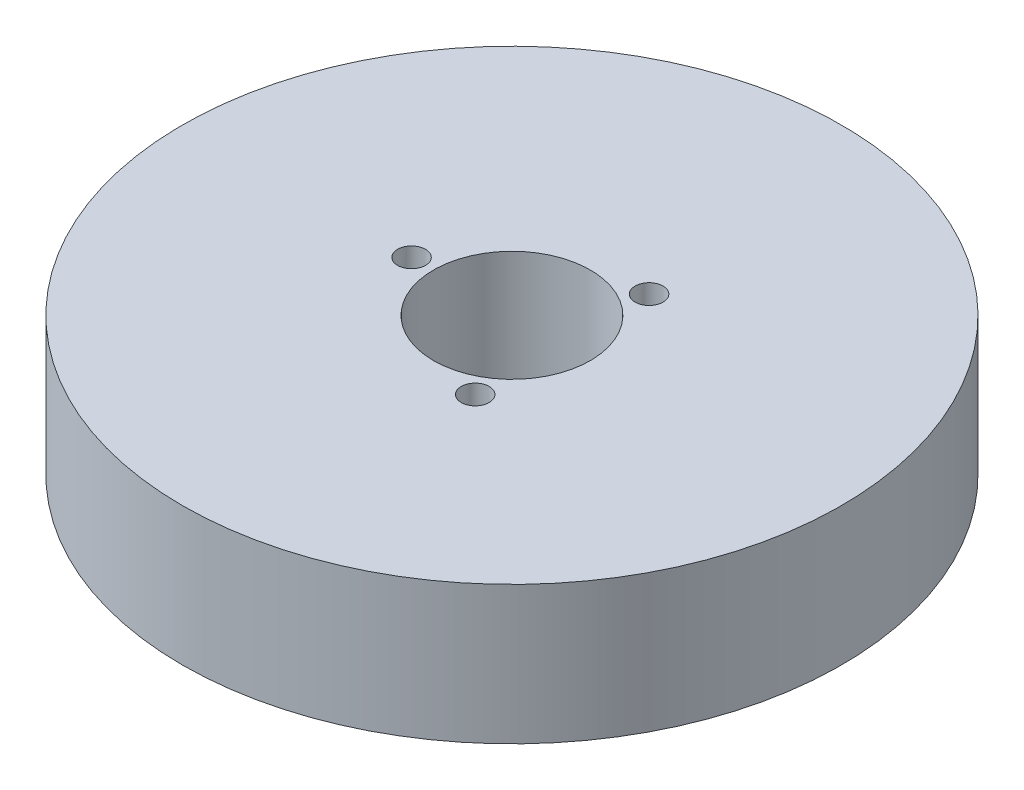
ISO-10303-21;
HEADER;
FILE_DESCRIPTION(('STEP AP214'),'2;1');
FILE_NAME('part.step','',(''),(''),'','','');
FILE_SCHEMA(('AUTOMOTIVE_DESIGN { 1 0 10303 214 1 1 1 1 }'));
ENDSEC;
DATA;
#1=APPLICATION_CONTEXT('core data for automotive mechanical design processes');
#2=APPLICATION_PROTOCOL_DEFINITION('international standard','automotive_design',2000,#1);
#3=PRODUCT_CONTEXT('',#1,'mechanical');
#4=PRODUCT('Part','Part','',(#3));
#5=PRODUCT_RELATED_PRODUCT_CATEGORY('part','',(#4));
#6=PRODUCT_DEFINITION_FORMATION('','',#4);
#7=PRODUCT_DEFINITION_CONTEXT('part definition',#1,'design');
#8=PRODUCT_DEFINITION('design','',#6,#7);
#9=PRODUCT_DEFINITION_SHAPE('','',#8);
#10=(LENGTH_UNIT() NAMED_UNIT(*) SI_UNIT(.MILLI.,.METRE.));
#11=(NAMED_UNIT(*) PLANE_ANGLE_UNIT() SI_UNIT($,.RADIAN.));
#12=(NAMED_UNIT(*) SI_UNIT($,.STERADIAN.) SOLID_ANGLE_UNIT());
#13=UNCERTAINTY_MEASURE_WITH_UNIT(LENGTH_MEASURE(1.E-05),#10,'distance_accuracy_value','');
#14=(GEOMETRIC_REPRESENTATION_CONTEXT(3) GLOBAL_UNCERTAINTY_ASSIGNED_CONTEXT((#13)) GLOBAL_UNIT_ASSIGNED_CONTEXT((#10,
#11,#12)) REPRESENTATION_CONTEXT('',''));
#15=CARTESIAN_POINT('',(0.,0.,0.));
#16=DIRECTION('',(0.,0.,1.));
#17=DIRECTION('',(1.,0.,0.));
#18=AXIS2_PLACEMENT_3D('',#15,#16,#17);
#19=CARTESIAN_POINT('',(0.,22.,0.));
#20=DIRECTION('',(0.,-1.,0.));
#21=DIRECTION('',(0.,0.,-1.));
#22=AXIS2_PLACEMENT_3D('',#19,#20,#21);
#23=CYLINDRICAL_SURFACE('',#22,52.5);
#24=CARTESIAN_POINT('',(0.,22.,0.));
#25=DIRECTION('',(0.,1.,0.));
#26=DIRECTION('',(0.,0.,1.));
#27=AXIS2_PLACEMENT_3D('',#24,#25,#26);
#28=CIRCLE('',#27,52.5);
#29=CARTESIAN_POINT('',(0.,22.,52.5));
#30=VERTEX_POINT('',#29);
#31=EDGE_CURVE('E10',#30,#30,#28,.T.);
#32=ORIENTED_EDGE('',*,*,#31,.F.);
#33=EDGE_LOOP('',(#32));
#34=FACE_BOUND('',#33,.T.);
#35=CARTESIAN_POINT('',(0.,0.,0.));
#36=DIRECTION('',(0.,1.,0.));
#37=DIRECTION('',(0.,0.,1.));
#38=AXIS2_PLACEMENT_3D('',#35,#36,#37);
#39=CIRCLE('',#38,52.5);
#40=CARTESIAN_POINT('',(0.,0.,52.5));
#41=VERTEX_POINT('',#40);
#42=EDGE_CURVE('E37',#41,#41,#39,.T.);
#43=ORIENTED_EDGE('',*,*,#42,.T.);
#44=EDGE_LOOP('',(#43));
#45=FACE_BOUND('',#44,.T.);
#46=ADVANCED_FACE('F40',(#34,#45),#23,.T.);
#47=CARTESIAN_POINT('',(0.,22.,0.));
#48=DIRECTION('',(0.,1.,0.));
#49=DIRECTION('',(0.,0.,1.));
#50=AXIS2_PLACEMENT_3D('',#47,#48,#49);
#51=PLANE('',#50);
#52=CARTESIAN_POINT('',(7.99627412123453,22.,13.8499530492262));
#53=DIRECTION('',(0.,1.,0.));
#54=DIRECTION('',(0.866025403784436,0.,-0.500000000000004));
#55=AXIS2_PLACEMENT_3D('',#52,#53,#54);
#56=CIRCLE('',#55,2.22604315183564);
#57=CARTESIAN_POINT('',(9.92408404064456,22.,12.7369314733084));
#58=VERTEX_POINT('',#57);
#59=EDGE_CURVE('E70',#58,#58,#56,.T.);
#60=ORIENTED_EDGE('',*,*,#59,.F.);
#61=EDGE_LOOP('',(#60));
#62=FACE_BOUND('',#61,.T.);
#63=CARTESIAN_POINT('',(7.99627412123433,22.,-13.8499530492263));
#64=DIRECTION('',(0.,1.,0.));
#65=DIRECTION('',(-0.866025403784443,0.,-0.499999999999992));
#66=AXIS2_PLACEMENT_3D('',#63,#64,#65);
#67=CIRCLE('',#66,2.22604315183564);
#68=CARTESIAN_POINT('',(6.06846420182428,22.,-14.9629746251441));
#69=VERTEX_POINT('',#68);
#70=EDGE_CURVE('E61',#69,#69,#67,.T.);
#71=ORIENTED_EDGE('',*,*,#70,.F.);
#72=EDGE_LOOP('',(#71));
#73=FACE_BOUND('',#72,.T.);
#74=CARTESIAN_POINT('',(-15.9925482424689,22.,0.));
#75=DIRECTION('',(0.,1.,0.));
#76=DIRECTION('',(0.,0.,1.));
#77=AXIS2_PLACEMENT_3D('',#74,#75,#76);
#78=CIRCLE('',#77,2.22604315183564);
#79=CARTESIAN_POINT('',(-15.9925482424689,22.,2.22604315183564));
#80=VERTEX_POINT('',#79);
#81=EDGE_CURVE('E54',#80,#80,#78,.T.);
#82=ORIENTED_EDGE('',*,*,#81,.F.);
#83=EDGE_LOOP('',(#82));
#84=FACE_BOUND('',#83,.T.);
#85=CARTESIAN_POINT('',(0.,22.,0.));
#86=DIRECTION('',(0.,1.,0.));
#87=DIRECTION('',(0.,0.,1.));
#88=AXIS2_PLACEMENT_3D('',#85,#86,#87);
#89=CIRCLE('',#88,12.5);
#90=CARTESIAN_POINT('',(0.,22.,12.5));
#91=VERTEX_POINT('',#90);
#92=EDGE_CURVE('E50',#91,#91,#89,.T.);
#93=ORIENTED_EDGE('',*,*,#92,.F.);
#94=EDGE_LOOP('',(#93));
#95=FACE_BOUND('',#94,.T.);
#96=ORIENTED_EDGE('',*,*,#31,.T.);
#97=EDGE_LOOP('',(#96));
#98=FACE_BOUND('',#97,.T.);
#99=ADVANCED_FACE('F85',(#62,#73,#84,#95,#98),#51,.T.);
#100=CARTESIAN_POINT('',(0.,0.,0.));
#101=DIRECTION('',(0.,1.,0.));
#102=DIRECTION('',(0.,0.,1.));
#103=AXIS2_PLACEMENT_3D('',#100,#101,#102);
#104=PLANE('',#103);
#105=CARTESIAN_POINT('',(0.,0.,0.));
#106=DIRECTION('',(0.,1.,0.));
#107=DIRECTION('',(0.,0.,1.));
#108=AXIS2_PLACEMENT_3D('',#105,#106,#107);
#109=CIRCLE('',#108,12.5);
#110=CARTESIAN_POINT('',(0.,0.,12.5));
#111=VERTEX_POINT('',#110);
#112=EDGE_CURVE('E47',#111,#111,#109,.T.);
#113=ORIENTED_EDGE('',*,*,#112,.T.);
#114=EDGE_LOOP('',(#113));
#115=FACE_BOUND('',#114,.T.);
#116=ORIENTED_EDGE('',*,*,#42,.F.);
#117=EDGE_LOOP('',(#116));
#118=FACE_BOUND('',#117,.T.);
#119=ADVANCED_FACE('F84',(#115,#118),#104,.F.);
#120=CARTESIAN_POINT('',(0.,22.,0.));
#121=DIRECTION('',(0.,-1.,0.));
#122=DIRECTION('',(0.,0.,-1.));
#123=AXIS2_PLACEMENT_3D('',#120,#121,#122);
#124=CYLINDRICAL_SURFACE('',#123,12.5);
#125=ORIENTED_EDGE('',*,*,#92,.T.);
#126=EDGE_LOOP('',(#125));
#127=FACE_BOUND('',#126,.T.);
#128=ORIENTED_EDGE('',*,*,#112,.F.);
#129=EDGE_LOOP('',(#128));
#130=FACE_BOUND('',#129,.T.);
#131=ADVANCED_FACE('F91',(#127,#130),#124,.F.);
#132=CARTESIAN_POINT('',(-15.9925482424689,6.56872823832589,0.));
#133=DIRECTION('',(0.,1.,0.));
#134=DIRECTION('',(0.,0.,1.));
#135=AXIS2_PLACEMENT_3D('',#132,#133,#134);
#136=CYLINDRICAL_SURFACE('',#135,2.22604315183564);
#137=CARTESIAN_POINT('',(-15.9925482424689,6.56872823832589,0.));
#138=DIRECTION('',(0.,1.,0.));
#139=DIRECTION('',(0.,0.,1.));
#140=AXIS2_PLACEMENT_3D('',#137,#138,#139);
#141=CIRCLE('',#140,2.22604315183564);
#142=CARTESIAN_POINT('',(-15.9925482424689,6.56872823832589,2.22604315183564));
#143=VERTEX_POINT('',#142);
#144=EDGE_CURVE('E55',#143,#143,#141,.T.);
#145=ORIENTED_EDGE('',*,*,#144,.F.);
#146=EDGE_LOOP('',(#145));
#147=FACE_BOUND('',#146,.T.);
#148=ORIENTED_EDGE('',*,*,#81,.T.);
#149=EDGE_LOOP('',(#148));
#150=FACE_BOUND('',#149,.T.);
#151=ADVANCED_FACE('F96',(#147,#150),#136,.F.);
#152=CARTESIAN_POINT('',(-15.9925482424689,6.56872823832589,0.));
#153=DIRECTION('',(0.,1.,0.));
#154=DIRECTION('',(0.,0.,1.));
#155=AXIS2_PLACEMENT_3D('',#152,#153,#154);
#156=PLANE('',#155);
#157=ORIENTED_EDGE('',*,*,#144,.T.);
#158=EDGE_LOOP('',(#157));
#159=FACE_BOUND('',#158,.T.);
#160=ADVANCED_FACE('F127',(#159),#156,.T.);
#161=CARTESIAN_POINT('',(7.99627412123433,6.56872823832589,-13.8499530492263));
#162=DIRECTION('',(0.,1.,0.));
#163=DIRECTION('',(0.,0.,1.));
#164=AXIS2_PLACEMENT_3D('',#161,#162,#163);
#165=CYLINDRICAL_SURFACE('',#164,2.22604315183564);
#166=CARTESIAN_POINT('',(7.99627412123433,6.56872823832589,-13.8499530492263));
#167=DIRECTION('',(0.,1.,0.));
#168=DIRECTION('',(-0.866025403784443,0.,-0.499999999999992));
#169=AXIS2_PLACEMENT_3D('',#166,#167,#168);
#170=CIRCLE('',#169,2.22604315183564);
#171=CARTESIAN_POINT('',(6.06846420182428,6.56872823832589,-14.9629746251441));
#172=VERTEX_POINT('',#171);
#173=EDGE_CURVE('E63',#172,#172,#170,.T.);
#174=ORIENTED_EDGE('',*,*,#173,.F.);
#175=EDGE_LOOP('',(#174));
#176=FACE_BOUND('',#175,.T.);
#177=ORIENTED_EDGE('',*,*,#70,.T.);
#178=EDGE_LOOP('',(#177));
#179=FACE_BOUND('',#178,.T.);
#180=ADVANCED_FACE('F133',(#176,#179),#165,.F.);
#181=CARTESIAN_POINT('',(7.99627412123433,6.56872823832589,-13.8499530492263));
#182=DIRECTION('',(0.,1.,0.));
#183=DIRECTION('',(-0.866025403784443,0.,-0.499999999999992));
#184=AXIS2_PLACEMENT_3D('',#181,#182,#183);
#185=PLANE('',#184);
#186=ORIENTED_EDGE('',*,*,#173,.T.);
#187=EDGE_LOOP('',(#186));
#188=FACE_BOUND('',#187,.T.);
#189=ADVANCED_FACE('F77',(#188),#185,.T.);
#190=CARTESIAN_POINT('',(7.99627412123453,6.56872823832589,13.8499530492262));
#191=DIRECTION('',(0.,1.,0.));
#192=DIRECTION('',(0.,0.,1.));
#193=AXIS2_PLACEMENT_3D('',#190,#191,#192);
#194=CYLINDRICAL_SURFACE('',#193,2.22604315183564);
#195=CARTESIAN_POINT('',(7.99627412123453,6.56872823832589,13.8499530492262));
#196=DIRECTION('',(0.,1.,0.));
#197=DIRECTION('',(0.866025403784436,0.,-0.500000000000004));
#198=AXIS2_PLACEMENT_3D('',#195,#196,#197);
#199=CIRCLE('',#198,2.22604315183564);
#200=CARTESIAN_POINT('',(9.92408404064456,6.56872823832589,12.7369314733084));
#201=VERTEX_POINT('',#200);
#202=EDGE_CURVE('E59',#201,#201,#199,.T.);
#203=ORIENTED_EDGE('',*,*,#202,.F.);
#204=EDGE_LOOP('',(#203));
#205=FACE_BOUND('',#204,.T.);
#206=ORIENTED_EDGE('',*,*,#59,.T.);
#207=EDGE_LOOP('',(#206));
#208=FACE_BOUND('',#207,.T.);
#209=ADVANCED_FACE('F73',(#205,#208),#194,.F.);
#210=CARTESIAN_POINT('',(7.99627412123453,6.56872823832589,13.8499530492262));
#211=DIRECTION('',(0.,1.,0.));
#212=DIRECTION('',(0.866025403784436,0.,-0.500000000000004));
#213=AXIS2_PLACEMENT_3D('',#210,#211,#212);
#214=PLANE('',#213);
#215=ORIENTED_EDGE('',*,*,#202,.T.);
#216=EDGE_LOOP('',(#215));
#217=FACE_BOUND('',#216,.T.);
#218=ADVANCED_FACE('F71',(#217),#214,.T.);
#219=CLOSED_SHELL('',(#46,#99,#119,#131,#151,#160,#180,#189,#209,#218));
#220=MANIFOLD_SOLID_BREP('B2',#219);
#221=ADVANCED_BREP_SHAPE_REPRESENTATION('',(#18,#220),#14);
#222=SHAPE_DEFINITION_REPRESENTATION(#9,#221);
ENDSEC;
END-ISO-10303-21;
